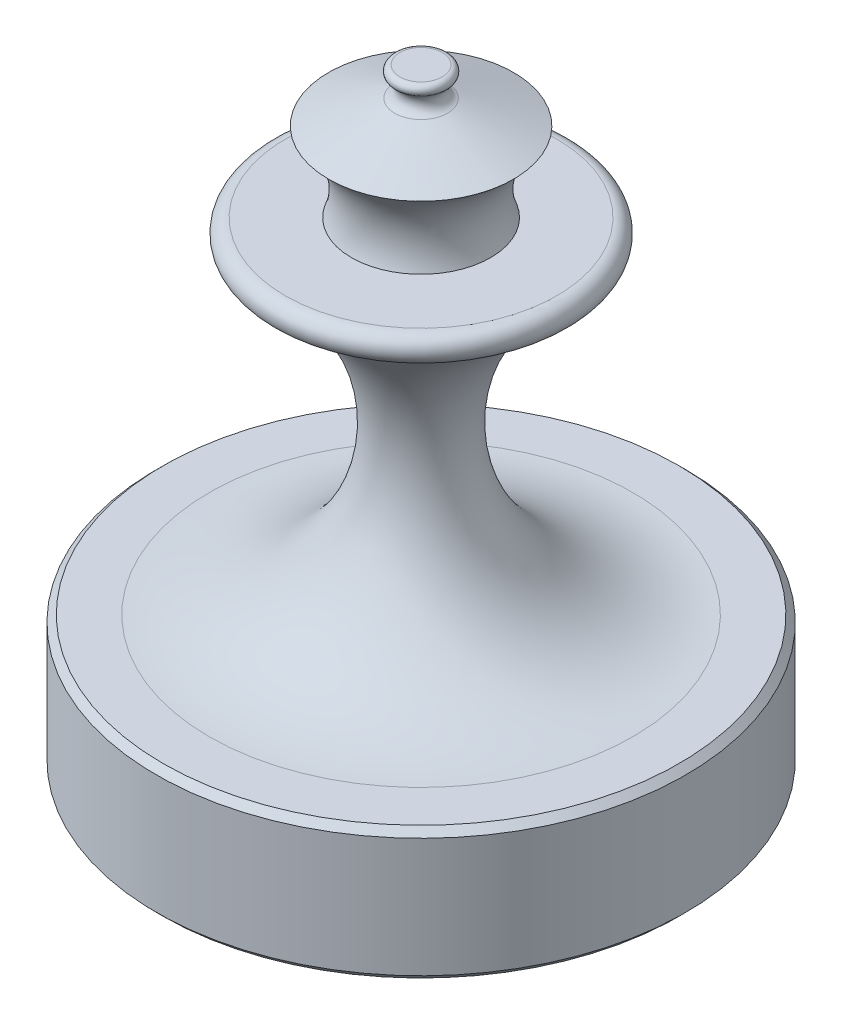
ISO-10303-21;
HEADER;
FILE_DESCRIPTION(('STEP AP214'),'2;1');
FILE_NAME('part.step','',(''),(''),'','','');
FILE_SCHEMA(('AUTOMOTIVE_DESIGN { 1 0 10303 214 1 1 1 1 }'));
ENDSEC;
DATA;
#1=APPLICATION_CONTEXT('core data for automotive mechanical design processes');
#2=APPLICATION_PROTOCOL_DEFINITION('international standard','automotive_design',2000,#1);
#3=PRODUCT_CONTEXT('',#1,'mechanical');
#4=PRODUCT('Part','Part','',(#3));
#5=PRODUCT_RELATED_PRODUCT_CATEGORY('part','',(#4));
#6=PRODUCT_DEFINITION_FORMATION('','',#4);
#7=PRODUCT_DEFINITION_CONTEXT('part definition',#1,'design');
#8=PRODUCT_DEFINITION('design','',#6,#7);
#9=PRODUCT_DEFINITION_SHAPE('','',#8);
#10=(LENGTH_UNIT() NAMED_UNIT(*) SI_UNIT(.MILLI.,.METRE.));
#11=(NAMED_UNIT(*) PLANE_ANGLE_UNIT() SI_UNIT($,.RADIAN.));
#12=(NAMED_UNIT(*) SI_UNIT($,.STERADIAN.) SOLID_ANGLE_UNIT());
#13=UNCERTAINTY_MEASURE_WITH_UNIT(LENGTH_MEASURE(1.E-05),#10,'distance_accuracy_value','');
#14=(GEOMETRIC_REPRESENTATION_CONTEXT(3) GLOBAL_UNCERTAINTY_ASSIGNED_CONTEXT((#13)) GLOBAL_UNIT_ASSIGNED_CONTEXT((#10,
#11,#12)) REPRESENTATION_CONTEXT('',''));
#15=CARTESIAN_POINT('',(0.,0.,0.));
#16=DIRECTION('',(0.,0.,1.));
#17=DIRECTION('',(1.,0.,0.));
#18=AXIS2_PLACEMENT_3D('',#15,#16,#17);
#19=CARTESIAN_POINT('',(0.,180.,0.));
#20=DIRECTION('',(0.,1.,0.));
#21=DIRECTION('',(0.,0.,1.));
#22=AXIS2_PLACEMENT_3D('',#19,#20,#21);
#23=PLANE('',#22);
#24=CARTESIAN_POINT('',(0.,180.,0.));
#25=DIRECTION('',(0.,1.,0.));
#26=DIRECTION('',(0.,0.,1.));
#27=AXIS2_PLACEMENT_3D('',#24,#25,#26);
#28=CIRCLE('',#27,8.);
#29=CARTESIAN_POINT('',(0.,180.,8.));
#30=VERTEX_POINT('',#29);
#31=EDGE_CURVE('E49',#30,#30,#28,.T.);
#32=ORIENTED_EDGE('',*,*,#31,.T.);
#33=EDGE_LOOP('',(#32));
#34=FACE_BOUND('',#33,.T.);
#35=ADVANCED_FACE('F29',(#34),#23,.T.);
#36=CARTESIAN_POINT('',(0.,177.916048736471,0.));
#37=DIRECTION('',(0.,1.,0.));
#38=DIRECTION('',(0.,0.,1.));
#39=AXIS2_PLACEMENT_3D('',#36,#37,#38);
#40=TOROIDAL_SURFACE('',#39,7.99999999999999,2.08395126352862);
#41=CARTESIAN_POINT('',(0.,176.171416731968,0.));
#42=DIRECTION('',(0.,1.,0.));
#43=DIRECTION('',(0.,0.,1.));
#44=AXIS2_PLACEMENT_3D('',#41,#42,#43);
#45=CIRCLE('',#44,9.13978596132047);
#46=CARTESIAN_POINT('',(0.,176.171416731968,9.13978596132047));
#47=VERTEX_POINT('',#46);
#48=EDGE_CURVE('E52',#47,#47,#45,.T.);
#49=ORIENTED_EDGE('',*,*,#48,.T.);
#50=EDGE_LOOP('',(#49));
#51=FACE_BOUND('',#50,.T.);
#52=ORIENTED_EDGE('',*,*,#31,.F.);
#53=EDGE_LOOP('',(#52));
#54=FACE_BOUND('',#53,.T.);
#55=ADVANCED_FACE('F92',(#51,#54),#40,.T.);
#56=CARTESIAN_POINT('',(0.,172.829329906727,0.));
#57=DIRECTION('',(0.,1.,0.));
#58=DIRECTION('',(0.,0.,1.));
#59=AXIS2_PLACEMENT_3D('',#56,#57,#58);
#60=TOROIDAL_SURFACE('',#59,11.3232055220584,3.99210036517856);
#61=CARTESIAN_POINT('',(0.,169.076905642085,0.));
#62=DIRECTION('',(0.,1.,0.));
#63=DIRECTION('',(0.,0.,1.));
#64=AXIS2_PLACEMENT_3D('',#61,#62,#63);
#65=CIRCLE('',#64,9.96078948288939);
#66=CARTESIAN_POINT('',(0.,169.076905642085,9.96078948288939));
#67=VERTEX_POINT('',#66);
#68=EDGE_CURVE('E55',#67,#67,#65,.T.);
#69=ORIENTED_EDGE('',*,*,#68,.T.);
#70=EDGE_LOOP('',(#69));
#71=FACE_BOUND('',#70,.T.);
#72=ORIENTED_EDGE('',*,*,#48,.F.);
#73=EDGE_LOOP('',(#72));
#74=FACE_BOUND('',#73,.T.);
#75=ADVANCED_FACE('F98',(#71,#74),#60,.F.);
#76=CARTESIAN_POINT('',(0.,169.076905642085,0.));
#77=DIRECTION('',(0.,-1.,0.));
#78=DIRECTION('',(0.,0.,-1.));
#79=AXIS2_PLACEMENT_3D('',#76,#77,#78);
#80=CONICAL_SURFACE('',#79,9.96078948288939,1.2225201325678);
#81=CARTESIAN_POINT('',(0.,160.,0.));
#82=DIRECTION('',(0.,1.,0.));
#83=DIRECTION('',(0.,0.,1.));
#84=AXIS2_PLACEMENT_3D('',#81,#82,#83);
#85=CIRCLE('',#84,34.9607894828894);
#86=CARTESIAN_POINT('',(0.,160.,34.9607894828894));
#87=VERTEX_POINT('',#86);
#88=EDGE_CURVE('E58',#87,#87,#85,.T.);
#89=ORIENTED_EDGE('',*,*,#88,.T.);
#90=EDGE_LOOP('',(#89));
#91=FACE_BOUND('',#90,.T.);
#92=ORIENTED_EDGE('',*,*,#68,.F.);
#93=EDGE_LOOP('',(#92));
#94=FACE_BOUND('',#93,.T.);
#95=ADVANCED_FACE('F104',(#91,#94),#80,.T.);
#96=CARTESIAN_POINT('',(0.,139.393940206875,0.));
#97=DIRECTION('',(0.,1.,0.));
#98=DIRECTION('',(0.,0.,1.));
#99=AXIS2_PLACEMENT_3D('',#96,#97,#98);
#100=TOROIDAL_SURFACE('',#99,50.0763472205778,25.5556214152431);
#101=CARTESIAN_POINT('',(0.,130.,0.));
#102=DIRECTION('',(0.,1.,0.));
#103=DIRECTION('',(0.,0.,1.));
#104=AXIS2_PLACEMENT_3D('',#101,#102,#103);
#105=CIRCLE('',#104,26.3099071567211);
#106=CARTESIAN_POINT('',(0.,130.,26.3099071567211));
#107=VERTEX_POINT('',#106);
#108=EDGE_CURVE('E61',#107,#107,#105,.T.);
#109=ORIENTED_EDGE('',*,*,#108,.T.);
#110=EDGE_LOOP('',(#109));
#111=FACE_BOUND('',#110,.T.);
#112=ORIENTED_EDGE('',*,*,#88,.F.);
#113=EDGE_LOOP('',(#112));
#114=FACE_BOUND('',#113,.T.);
#115=ADVANCED_FACE('F108',(#111,#114),#100,.F.);
#116=CARTESIAN_POINT('',(-51.3099071567212,130.,0.));
#117=DIRECTION('',(0.,1.,0.));
#118=DIRECTION('',(0.,0.,1.));
#119=AXIS2_PLACEMENT_3D('',#116,#117,#118);
#120=PLANE('',#119);
#121=CARTESIAN_POINT('',(0.,130.,0.));
#122=DIRECTION('',(0.,1.,0.));
#123=DIRECTION('',(0.,0.,1.));
#124=AXIS2_PLACEMENT_3D('',#121,#122,#123);
#125=CIRCLE('',#124,51.3099071567212);
#126=CARTESIAN_POINT('',(0.,130.,51.3099071567212));
#127=VERTEX_POINT('',#126);
#128=EDGE_CURVE('E64',#127,#127,#125,.T.);
#129=ORIENTED_EDGE('',*,*,#128,.T.);
#130=EDGE_LOOP('',(#129));
#131=FACE_BOUND('',#130,.T.);
#132=ORIENTED_EDGE('',*,*,#108,.F.);
#133=EDGE_LOOP('',(#132));
#134=FACE_BOUND('',#133,.T.);
#135=ADVANCED_FACE('F112',(#131,#134),#120,.T.);
#136=CARTESIAN_POINT('',(0.,124.863743361701,0.));
#137=DIRECTION('',(0.,1.,0.));
#138=DIRECTION('',(0.,0.,1.));
#139=AXIS2_PLACEMENT_3D('',#136,#137,#138);
#140=TOROIDAL_SURFACE('',#139,51.3099071567212,5.13625663829899);
#141=CARTESIAN_POINT('',(0.,120.204576824343,0.));
#142=DIRECTION('',(0.,1.,0.));
#143=DIRECTION('',(0.,0.,1.));
#144=AXIS2_PLACEMENT_3D('',#141,#142,#143);
#145=CIRCLE('',#144,53.4716886978658);
#146=CARTESIAN_POINT('',(0.,120.204576824343,53.4716886978658));
#147=VERTEX_POINT('',#146);
#148=EDGE_CURVE('E67',#147,#147,#145,.T.);
#149=ORIENTED_EDGE('',*,*,#148,.T.);
#150=EDGE_LOOP('',(#149));
#151=FACE_BOUND('',#150,.T.);
#152=ORIENTED_EDGE('',*,*,#128,.F.);
#153=EDGE_LOOP('',(#152));
#154=FACE_BOUND('',#153,.T.);
#155=ADVANCED_FACE('F116',(#151,#154),#140,.T.);
#156=CARTESIAN_POINT('',(0.,63.0295950053778,0.));
#157=DIRECTION('',(0.,1.,0.));
#158=DIRECTION('',(0.,0.,1.));
#159=AXIS2_PLACEMENT_3D('',#156,#157,#158);
#160=TOROIDAL_SURFACE('',#159,80.,63.0295950053778);
#161=CARTESIAN_POINT('',(0.,0.,0.));
#162=DIRECTION('',(0.,1.,0.));
#163=DIRECTION('',(0.,0.,1.));
#164=AXIS2_PLACEMENT_3D('',#161,#162,#163);
#165=CIRCLE('',#164,80.);
#166=CARTESIAN_POINT('',(0.,0.,80.));
#167=VERTEX_POINT('',#166);
#168=EDGE_CURVE('E70',#167,#167,#165,.T.);
#169=ORIENTED_EDGE('',*,*,#168,.T.);
#170=EDGE_LOOP('',(#169));
#171=FACE_BOUND('',#170,.T.);
#172=ORIENTED_EDGE('',*,*,#148,.F.);
#173=EDGE_LOOP('',(#172));
#174=FACE_BOUND('',#173,.T.);
#175=ADVANCED_FACE('F74',(#171,#174),#160,.F.);
#176=CARTESIAN_POINT('',(0.,-50.,0.));
#177=DIRECTION('',(0.,1.,0.));
#178=DIRECTION('',(0.,0.,1.));
#179=AXIS2_PLACEMENT_3D('',#176,#177,#178);
#180=CYLINDRICAL_SURFACE('',#179,100.);
#181=CARTESIAN_POINT('',(0.,-47.5,0.));
#182=DIRECTION('',(0.,-1.,0.));
#183=DIRECTION('',(0.,0.,-1.));
#184=AXIS2_PLACEMENT_3D('',#181,#182,#183);
#185=CIRCLE('',#184,100.);
#186=CARTESIAN_POINT('',(0.,-47.5,-100.));
#187=VERTEX_POINT('',#186);
#188=EDGE_CURVE('E36',#187,#187,#185,.F.);
#189=ORIENTED_EDGE('',*,*,#188,.T.);
#190=EDGE_LOOP('',(#189));
#191=FACE_BOUND('',#190,.T.);
#192=CARTESIAN_POINT('',(0.,-2.5,0.));
#193=DIRECTION('',(0.,-1.,0.));
#194=DIRECTION('',(0.,0.,-1.));
#195=AXIS2_PLACEMENT_3D('',#192,#193,#194);
#196=CIRCLE('',#195,100.);
#197=CARTESIAN_POINT('',(0.,-2.5,-100.));
#198=VERTEX_POINT('',#197);
#199=EDGE_CURVE('E40',#198,#198,#196,.T.);
#200=ORIENTED_EDGE('',*,*,#199,.T.);
#201=EDGE_LOOP('',(#200));
#202=FACE_BOUND('',#201,.T.);
#203=ADVANCED_FACE('F87',(#191,#202),#180,.T.);
#204=CARTESIAN_POINT('',(0.,-50.,0.));
#205=DIRECTION('',(0.,-1.,0.));
#206=DIRECTION('',(0.,0.,-1.));
#207=AXIS2_PLACEMENT_3D('',#204,#205,#206);
#208=PLANE('',#207);
#209=CARTESIAN_POINT('',(0.,-50.,0.));
#210=DIRECTION('',(0.,-1.,0.));
#211=DIRECTION('',(0.,0.,-1.));
#212=AXIS2_PLACEMENT_3D('',#209,#210,#211);
#213=CIRCLE('',#212,97.5);
#214=CARTESIAN_POINT('',(0.,-50.,-97.5));
#215=VERTEX_POINT('',#214);
#216=EDGE_CURVE('E44',#215,#215,#213,.T.);
#217=ORIENTED_EDGE('',*,*,#216,.T.);
#218=EDGE_LOOP('',(#217));
#219=FACE_BOUND('',#218,.T.);
#220=ADVANCED_FACE('F80',(#219),#208,.T.);
#221=CARTESIAN_POINT('',(0.,0.,0.));
#222=DIRECTION('',(0.,-1.,0.));
#223=DIRECTION('',(0.,0.,-1.));
#224=AXIS2_PLACEMENT_3D('',#221,#222,#223);
#225=PLANE('',#224);
#226=CARTESIAN_POINT('',(0.,0.,0.));
#227=DIRECTION('',(0.,-1.,0.));
#228=DIRECTION('',(0.,0.,-1.));
#229=AXIS2_PLACEMENT_3D('',#226,#227,#228);
#230=CIRCLE('',#229,97.5);
#231=CARTESIAN_POINT('',(0.,0.,-97.5));
#232=VERTEX_POINT('',#231);
#233=EDGE_CURVE('E10',#232,#232,#230,.F.);
#234=ORIENTED_EDGE('',*,*,#233,.T.);
#235=EDGE_LOOP('',(#234));
#236=FACE_BOUND('',#235,.T.);
#237=ORIENTED_EDGE('',*,*,#168,.F.);
#238=EDGE_LOOP('',(#237));
#239=FACE_BOUND('',#238,.T.);
#240=ADVANCED_FACE('F77',(#236,#239),#225,.F.);
#241=CARTESIAN_POINT('',(0.,-50.,0.));
#242=DIRECTION('',(0.,1.,0.));
#243=DIRECTION('',(0.,0.,1.));
#244=AXIS2_PLACEMENT_3D('',#241,#242,#243);
#245=CONICAL_SURFACE('',#244,97.5,0.785398163397434);
#246=ORIENTED_EDGE('',*,*,#188,.F.);
#247=EDGE_LOOP('',(#246));
#248=FACE_BOUND('',#247,.T.);
#249=ORIENTED_EDGE('',*,*,#216,.F.);
#250=EDGE_LOOP('',(#249));
#251=FACE_BOUND('',#250,.T.);
#252=ADVANCED_FACE('F79',(#248,#251),#245,.T.);
#253=CARTESIAN_POINT('',(0.,-2.5,0.));
#254=DIRECTION('',(0.,-1.,0.));
#255=DIRECTION('',(0.,0.,-1.));
#256=AXIS2_PLACEMENT_3D('',#253,#254,#255);
#257=CONICAL_SURFACE('',#256,100.,0.785398163397443);
#258=ORIENTED_EDGE('',*,*,#233,.F.);
#259=EDGE_LOOP('',(#258));
#260=FACE_BOUND('',#259,.T.);
#261=ORIENTED_EDGE('',*,*,#199,.F.);
#262=EDGE_LOOP('',(#261));
#263=FACE_BOUND('',#262,.T.);
#264=ADVANCED_FACE('F31',(#260,#263),#257,.T.);
#265=CLOSED_SHELL('',(#35,#55,#75,#95,#115,#135,#155,#175,#203,#220,#240,#252,#264));
#266=MANIFOLD_SOLID_BREP('B2',#265);
#267=ADVANCED_BREP_SHAPE_REPRESENTATION('',(#18,#266),#14);
#268=SHAPE_DEFINITION_REPRESENTATION(#9,#267);
ENDSEC;
END-ISO-10303-21;
